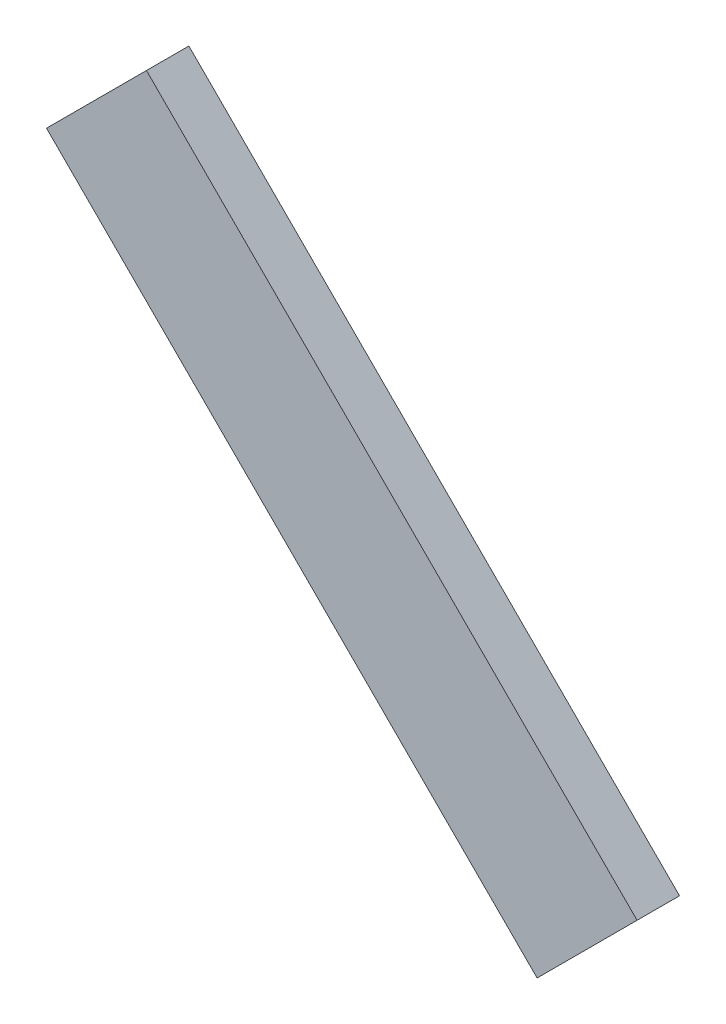
ISO-10303-21;
HEADER;
FILE_DESCRIPTION(('STEP AP214'),'2;1');
FILE_NAME('part.step','',(''),(''),'','','');
FILE_SCHEMA(('AUTOMOTIVE_DESIGN { 1 0 10303 214 1 1 1 1 }'));
ENDSEC;
DATA;
#1=APPLICATION_CONTEXT('core data for automotive mechanical design processes');
#2=APPLICATION_PROTOCOL_DEFINITION('international standard','automotive_design',2000,#1);
#3=PRODUCT_CONTEXT('',#1,'mechanical');
#4=PRODUCT('Part','Part','',(#3));
#5=PRODUCT_RELATED_PRODUCT_CATEGORY('part','',(#4));
#6=PRODUCT_DEFINITION_FORMATION('','',#4);
#7=PRODUCT_DEFINITION_CONTEXT('part definition',#1,'design');
#8=PRODUCT_DEFINITION('design','',#6,#7);
#9=PRODUCT_DEFINITION_SHAPE('','',#8);
#10=(LENGTH_UNIT() NAMED_UNIT(*) SI_UNIT(.MILLI.,.METRE.));
#11=(NAMED_UNIT(*) PLANE_ANGLE_UNIT() SI_UNIT($,.RADIAN.));
#12=(NAMED_UNIT(*) SI_UNIT($,.STERADIAN.) SOLID_ANGLE_UNIT());
#13=UNCERTAINTY_MEASURE_WITH_UNIT(LENGTH_MEASURE(1.E-05),#10,'distance_accuracy_value','');
#14=(GEOMETRIC_REPRESENTATION_CONTEXT(3) GLOBAL_UNCERTAINTY_ASSIGNED_CONTEXT((#13)) GLOBAL_UNIT_ASSIGNED_CONTEXT((#10,
#11,#12)) REPRESENTATION_CONTEXT('',''));
#15=CARTESIAN_POINT('',(0.,0.,0.));
#16=DIRECTION('',(0.,0.,1.));
#17=DIRECTION('',(1.,0.,0.));
#18=AXIS2_PLACEMENT_3D('',#15,#16,#17);
#19=CARTESIAN_POINT('',(378.163095966645,-378.163095966633,3.));
#20=DIRECTION('',(0.707106781186559,-0.707106781186536,0.));
#21=DIRECTION('',(0.707106781186536,0.707106781186559,0.));
#22=AXIS2_PLACEMENT_3D('',#19,#20,#21);
#23=PLANE('',#22);
#24=DIRECTION('',(-0.707106781186536,-0.707106781186559,0.));
#25=VECTOR('',#24,1.);
#26=CARTESIAN_POINT('',(378.163095966645,-378.163095966633,0.));
#27=LINE('',#26,#25);
#28=CARTESIAN_POINT('',(2299.06769177928,1542.74149984606,0.));
#29=VERTEX_POINT('',#28);
#30=CARTESIAN_POINT('',(2291.99662396741,1535.6704320342,0.));
#31=VERTEX_POINT('',#30);
#32=EDGE_CURVE('E107',#29,#31,#27,.T.);
#33=ORIENTED_EDGE('',*,*,#32,.F.);
#34=DIRECTION('',(0.,0.,-1.));
#35=VECTOR('',#34,1.);
#36=CARTESIAN_POINT('',(2299.06769177928,1542.74149984606,3.));
#37=LINE('',#36,#35);
#38=CARTESIAN_POINT('',(2299.06769177928,1542.74149984606,3.));
#39=VERTEX_POINT('',#38);
#40=EDGE_CURVE('E11',#39,#29,#37,.T.);
#41=ORIENTED_EDGE('',*,*,#40,.F.);
#42=DIRECTION('',(-0.707106781186536,-0.707106781186559,0.));
#43=VECTOR('',#42,1.);
#44=CARTESIAN_POINT('',(378.163095966645,-378.163095966633,3.));
#45=LINE('',#44,#43);
#46=CARTESIAN_POINT('',(2291.99662396741,1535.6704320342,3.));
#47=VERTEX_POINT('',#46);
#48=EDGE_CURVE('E97',#39,#47,#45,.T.);
#49=ORIENTED_EDGE('',*,*,#48,.T.);
#50=DIRECTION('',(0.,0.,-1.));
#51=VECTOR('',#50,1.);
#52=CARTESIAN_POINT('',(2291.99662396741,1535.6704320342,3.));
#53=LINE('',#52,#51);
#54=EDGE_CURVE('E78',#47,#31,#53,.T.);
#55=ORIENTED_EDGE('',*,*,#54,.T.);
#56=EDGE_LOOP('',(#33,#41,#49,#55));
#57=FACE_BOUND('',#56,.T.);
#58=ADVANCED_FACE('F39',(#57),#23,.T.);
#59=CARTESIAN_POINT('',(1920.90459581266,1920.90459581267,3.));
#60=DIRECTION('',(0.707106781186545,0.70710678118655,0.));
#61=DIRECTION('',(-0.70710678118655,0.707106781186545,0.));
#62=AXIS2_PLACEMENT_3D('',#59,#60,#61);
#63=PLANE('',#62);
#64=DIRECTION('',(0.70710678118655,-0.707106781186545,0.));
#65=VECTOR('',#64,1.);
#66=CARTESIAN_POINT('',(1920.90459581266,1920.90459581267,0.));
#67=LINE('',#66,#65);
#68=CARTESIAN_POINT('',(2264.36289095864,1577.4463006667,0.));
#69=VERTEX_POINT('',#68);
#70=EDGE_CURVE('E89',#69,#29,#67,.T.);
#71=ORIENTED_EDGE('',*,*,#70,.F.);
#72=DIRECTION('',(0.,0.,-1.));
#73=VECTOR('',#72,1.);
#74=CARTESIAN_POINT('',(2264.36289095864,1577.4463006667,3.));
#75=LINE('',#74,#73);
#76=CARTESIAN_POINT('',(2264.36289095864,1577.4463006667,3.));
#77=VERTEX_POINT('',#76);
#78=EDGE_CURVE('E48',#77,#69,#75,.T.);
#79=ORIENTED_EDGE('',*,*,#78,.F.);
#80=DIRECTION('',(0.70710678118655,-0.707106781186545,0.));
#81=VECTOR('',#80,1.);
#82=CARTESIAN_POINT('',(1920.90459581266,1920.90459581267,3.));
#83=LINE('',#82,#81);
#84=EDGE_CURVE('E87',#77,#39,#83,.T.);
#85=ORIENTED_EDGE('',*,*,#84,.T.);
#86=ORIENTED_EDGE('',*,*,#40,.T.);
#87=EDGE_LOOP('',(#71,#79,#85,#86));
#88=FACE_BOUND('',#87,.T.);
#89=ADVANCED_FACE('F86',(#88),#63,.T.);
#90=CARTESIAN_POINT('',(343.45829514615,-343.458295146096,3.));
#91=DIRECTION('',(-0.707106781186603,0.707106781186492,0.));
#92=DIRECTION('',(-0.707106781186492,-0.707106781186603,0.));
#93=AXIS2_PLACEMENT_3D('',#90,#91,#92);
#94=PLANE('',#93);
#95=DIRECTION('',(0.707106781186492,0.707106781186603,0.));
#96=VECTOR('',#95,1.);
#97=CARTESIAN_POINT('',(343.45829514615,-343.458295146096,0.));
#98=LINE('',#97,#96);
#99=CARTESIAN_POINT('',(2257.29182314678,1570.37523285483,0.));
#100=VERTEX_POINT('',#99);
#101=EDGE_CURVE('E113',#100,#69,#98,.T.);
#102=ORIENTED_EDGE('',*,*,#101,.F.);
#103=DIRECTION('',(0.,0.,-1.));
#104=VECTOR('',#103,1.);
#105=CARTESIAN_POINT('',(2257.29182314678,1570.37523285483,3.));
#106=LINE('',#105,#104);
#107=CARTESIAN_POINT('',(2257.29182314678,1570.37523285483,3.));
#108=VERTEX_POINT('',#107);
#109=EDGE_CURVE('E71',#108,#100,#106,.T.);
#110=ORIENTED_EDGE('',*,*,#109,.F.);
#111=DIRECTION('',(0.707106781186492,0.707106781186603,0.));
#112=VECTOR('',#111,1.);
#113=CARTESIAN_POINT('',(343.45829514615,-343.458295146096,3.));
#114=LINE('',#113,#112);
#115=EDGE_CURVE('E96',#108,#77,#114,.T.);
#116=ORIENTED_EDGE('',*,*,#115,.T.);
#117=ORIENTED_EDGE('',*,*,#78,.T.);
#118=EDGE_LOOP('',(#102,#110,#116,#117));
#119=FACE_BOUND('',#118,.T.);
#120=ADVANCED_FACE('F100',(#119),#94,.T.);
#121=CARTESIAN_POINT('',(1913.83352800077,1913.83352800083,3.));
#122=DIRECTION('',(0.707106781186536,0.707106781186559,0.));
#123=DIRECTION('',(-0.707106781186559,0.707106781186536,0.));
#124=AXIS2_PLACEMENT_3D('',#121,#122,#123);
#125=PLANE('',#124);
#126=DIRECTION('',(0.707106781186559,-0.707106781186536,0.));
#127=VECTOR('',#126,1.);
#128=CARTESIAN_POINT('',(1913.83352800077,1913.83352800083,0.));
#129=LINE('',#128,#127);
#130=EDGE_CURVE('E116',#100,#31,#129,.T.);
#131=ORIENTED_EDGE('',*,*,#130,.T.);
#132=ORIENTED_EDGE('',*,*,#54,.F.);
#133=DIRECTION('',(0.707106781186559,-0.707106781186536,0.));
#134=VECTOR('',#133,1.);
#135=CARTESIAN_POINT('',(1913.83352800077,1913.83352800083,3.));
#136=LINE('',#135,#134);
#137=EDGE_CURVE('E56',#108,#47,#136,.T.);
#138=ORIENTED_EDGE('',*,*,#137,.F.);
#139=ORIENTED_EDGE('',*,*,#109,.T.);
#140=EDGE_LOOP('',(#131,#132,#138,#139));
#141=FACE_BOUND('',#140,.T.);
#142=ADVANCED_FACE('F130',(#141),#125,.F.);
#143=CARTESIAN_POINT('',(0.,0.,3.));
#144=DIRECTION('',(0.,0.,1.));
#145=DIRECTION('',(1.,0.,0.));
#146=AXIS2_PLACEMENT_3D('',#143,#144,#145);
#147=PLANE('',#146);
#148=ORIENTED_EDGE('',*,*,#48,.F.);
#149=ORIENTED_EDGE('',*,*,#84,.F.);
#150=ORIENTED_EDGE('',*,*,#115,.F.);
#151=ORIENTED_EDGE('',*,*,#137,.T.);
#152=EDGE_LOOP('',(#148,#149,#150,#151));
#153=FACE_BOUND('',#152,.T.);
#154=ADVANCED_FACE('F95',(#153),#147,.T.);
#155=CARTESIAN_POINT('',(0.,0.,0.));
#156=DIRECTION('',(0.,0.,1.));
#157=DIRECTION('',(1.,0.,0.));
#158=AXIS2_PLACEMENT_3D('',#155,#156,#157);
#159=PLANE('',#158);
#160=ORIENTED_EDGE('',*,*,#32,.T.);
#161=ORIENTED_EDGE('',*,*,#130,.F.);
#162=ORIENTED_EDGE('',*,*,#101,.T.);
#163=ORIENTED_EDGE('',*,*,#70,.T.);
#164=EDGE_LOOP('',(#160,#161,#162,#163));
#165=FACE_BOUND('',#164,.T.);
#166=ADVANCED_FACE('F135',(#165),#159,.F.);
#167=CLOSED_SHELL('',(#58,#89,#120,#142,#154,#166));
#168=MANIFOLD_SOLID_BREP('B2',#167);
#169=ADVANCED_BREP_SHAPE_REPRESENTATION('',(#18,#168),#14);
#170=SHAPE_DEFINITION_REPRESENTATION(#9,#169);
ENDSEC;
END-ISO-10303-21;
